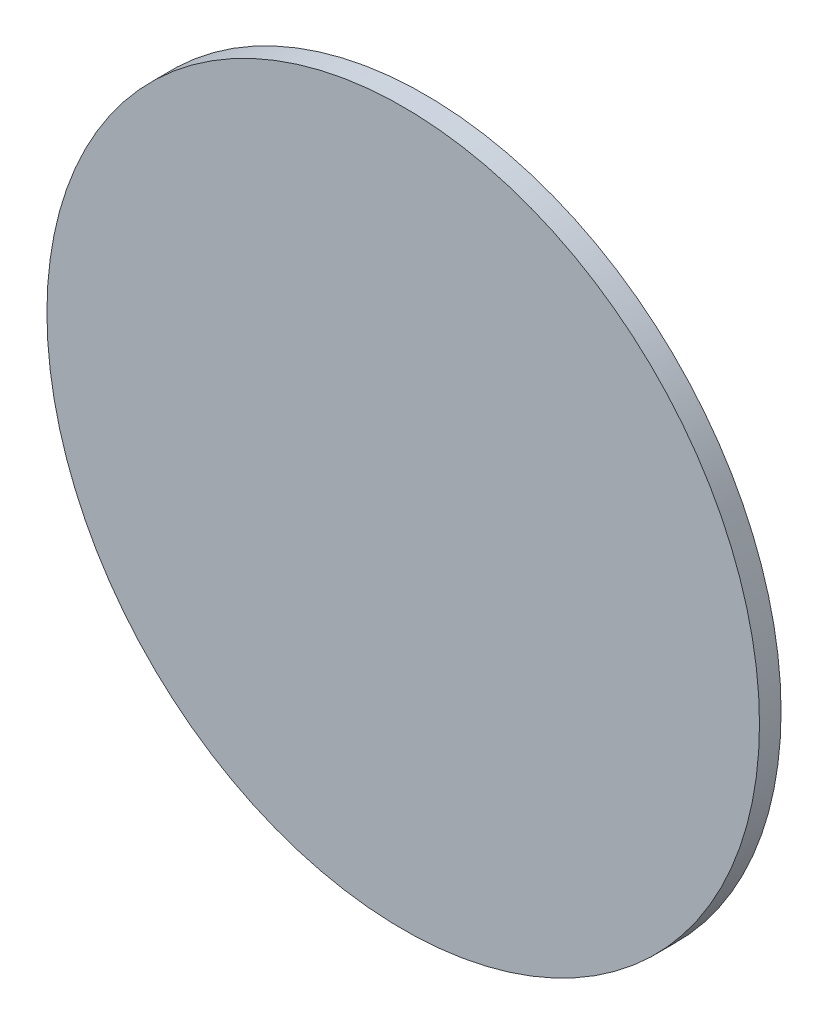
ISO-10303-21;
HEADER;
FILE_DESCRIPTION(('STEP AP214'),'2;1');
FILE_NAME('part.step','',(''),(''),'','','');
FILE_SCHEMA(('AUTOMOTIVE_DESIGN { 1 0 10303 214 1 1 1 1 }'));
ENDSEC;
DATA;
#1=APPLICATION_CONTEXT('core data for automotive mechanical design processes');
#2=APPLICATION_PROTOCOL_DEFINITION('international standard','automotive_design',2000,#1);
#3=PRODUCT_CONTEXT('',#1,'mechanical');
#4=PRODUCT('Part','Part','',(#3));
#5=PRODUCT_RELATED_PRODUCT_CATEGORY('part','',(#4));
#6=PRODUCT_DEFINITION_FORMATION('','',#4);
#7=PRODUCT_DEFINITION_CONTEXT('part definition',#1,'design');
#8=PRODUCT_DEFINITION('design','',#6,#7);
#9=PRODUCT_DEFINITION_SHAPE('','',#8);
#10=(LENGTH_UNIT() NAMED_UNIT(*) SI_UNIT(.MILLI.,.METRE.));
#11=(NAMED_UNIT(*) PLANE_ANGLE_UNIT() SI_UNIT($,.RADIAN.));
#12=(NAMED_UNIT(*) SI_UNIT($,.STERADIAN.) SOLID_ANGLE_UNIT());
#13=UNCERTAINTY_MEASURE_WITH_UNIT(LENGTH_MEASURE(1.E-05),#10,'distance_accuracy_value','');
#14=(GEOMETRIC_REPRESENTATION_CONTEXT(3) GLOBAL_UNCERTAINTY_ASSIGNED_CONTEXT((#13)) GLOBAL_UNIT_ASSIGNED_CONTEXT((#10,
#11,#12)) REPRESENTATION_CONTEXT('',''));
#15=CARTESIAN_POINT('',(0.,0.,0.));
#16=DIRECTION('',(0.,0.,1.));
#17=DIRECTION('',(1.,0.,0.));
#18=AXIS2_PLACEMENT_3D('',#15,#16,#17);
#19=CARTESIAN_POINT('',(0.,0.,0.508));
#20=DIRECTION('',(0.,0.,-1.));
#21=DIRECTION('',(-1.,0.,0.));
#22=AXIS2_PLACEMENT_3D('',#19,#20,#21);
#23=CYLINDRICAL_SURFACE('',#22,8.382);
#24=CARTESIAN_POINT('',(0.,0.,0.508));
#25=DIRECTION('',(0.,0.,1.));
#26=DIRECTION('',(1.,0.,0.));
#27=AXIS2_PLACEMENT_3D('',#24,#25,#26);
#28=CIRCLE('',#27,8.382);
#29=CARTESIAN_POINT('',(8.382,0.,0.508));
#30=VERTEX_POINT('',#29);
#31=EDGE_CURVE('E12',#30,#30,#28,.T.);
#32=ORIENTED_EDGE('',*,*,#31,.F.);
#33=EDGE_LOOP('',(#32));
#34=FACE_BOUND('',#33,.T.);
#35=CARTESIAN_POINT('',(0.,0.,0.));
#36=DIRECTION('',(0.,0.,1.));
#37=DIRECTION('',(1.,0.,0.));
#38=AXIS2_PLACEMENT_3D('',#35,#36,#37);
#39=CIRCLE('',#38,8.382);
#40=CARTESIAN_POINT('',(8.382,0.,0.));
#41=VERTEX_POINT('',#40);
#42=EDGE_CURVE('E53',#41,#41,#39,.T.);
#43=ORIENTED_EDGE('',*,*,#42,.T.);
#44=EDGE_LOOP('',(#43));
#45=FACE_BOUND('',#44,.T.);
#46=ADVANCED_FACE('F50',(#34,#45),#23,.T.);
#47=CARTESIAN_POINT('',(0.,0.,0.508));
#48=DIRECTION('',(0.,0.,1.));
#49=DIRECTION('',(1.,0.,0.));
#50=AXIS2_PLACEMENT_3D('',#47,#48,#49);
#51=PLANE('',#50);
#52=ORIENTED_EDGE('',*,*,#31,.T.);
#53=EDGE_LOOP('',(#52));
#54=FACE_BOUND('',#53,.T.);
#55=ADVANCED_FACE('F65',(#54),#51,.T.);
#56=CARTESIAN_POINT('',(0.,0.,0.));
#57=DIRECTION('',(0.,0.,1.));
#58=DIRECTION('',(1.,0.,0.));
#59=AXIS2_PLACEMENT_3D('',#56,#57,#58);
#60=PLANE('',#59);
#61=ORIENTED_EDGE('',*,*,#42,.F.);
#62=EDGE_LOOP('',(#61));
#63=FACE_BOUND('',#62,.T.);
#64=ADVANCED_FACE('F63',(#63),#60,.F.);
#65=CLOSED_SHELL('',(#46,#55,#64));
#66=MANIFOLD_SOLID_BREP('B2',#65);
#67=ADVANCED_BREP_SHAPE_REPRESENTATION('',(#18,#66),#14);
#68=SHAPE_DEFINITION_REPRESENTATION(#9,#67);
ENDSEC;
END-ISO-10303-21;
